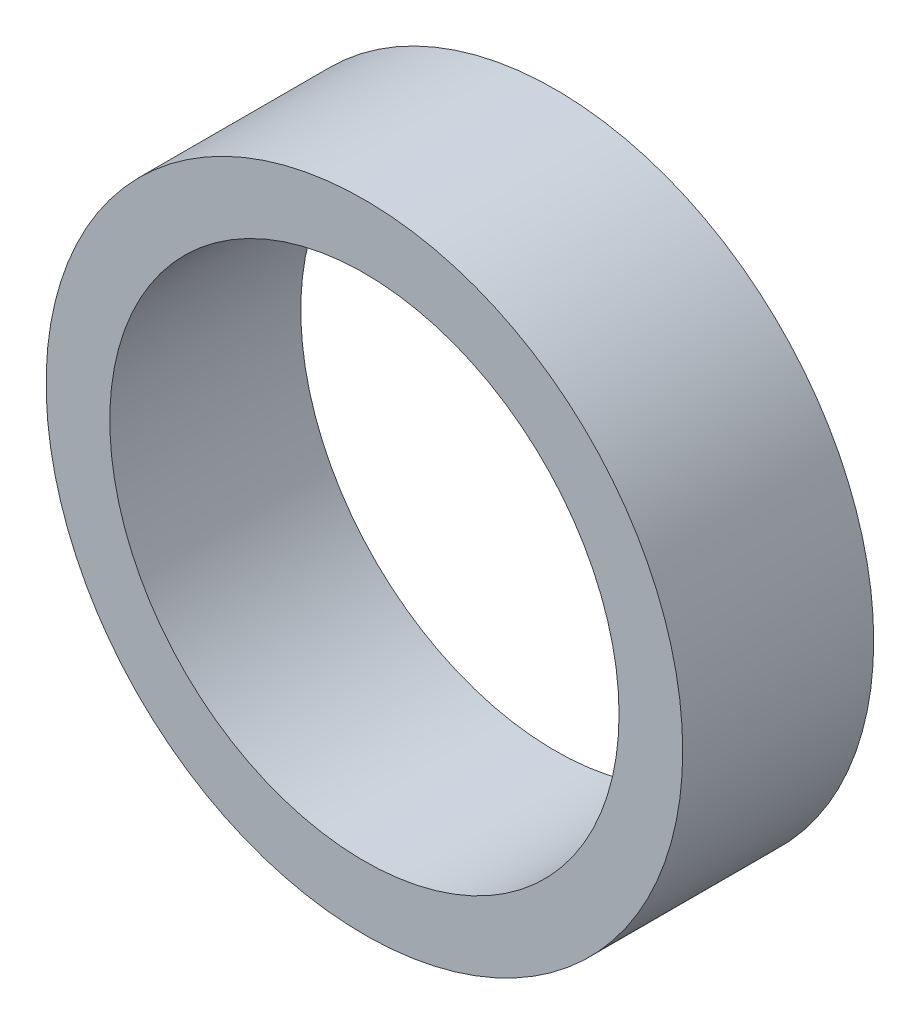
ISO-10303-21;
HEADER;
FILE_DESCRIPTION(('STEP AP214'),'2;1');
FILE_NAME('part.step','',(''),(''),'','','');
FILE_SCHEMA(('AUTOMOTIVE_DESIGN { 1 0 10303 214 1 1 1 1 }'));
ENDSEC;
DATA;
#1=APPLICATION_CONTEXT('core data for automotive mechanical design processes');
#2=APPLICATION_PROTOCOL_DEFINITION('international standard','automotive_design',2000,#1);
#3=PRODUCT_CONTEXT('',#1,'mechanical');
#4=PRODUCT('Part','Part','',(#3));
#5=PRODUCT_RELATED_PRODUCT_CATEGORY('part','',(#4));
#6=PRODUCT_DEFINITION_FORMATION('','',#4);
#7=PRODUCT_DEFINITION_CONTEXT('part definition',#1,'design');
#8=PRODUCT_DEFINITION('design','',#6,#7);
#9=PRODUCT_DEFINITION_SHAPE('','',#8);
#10=(LENGTH_UNIT() NAMED_UNIT(*) SI_UNIT(.MILLI.,.METRE.));
#11=(NAMED_UNIT(*) PLANE_ANGLE_UNIT() SI_UNIT($,.RADIAN.));
#12=(NAMED_UNIT(*) SI_UNIT($,.STERADIAN.) SOLID_ANGLE_UNIT());
#13=UNCERTAINTY_MEASURE_WITH_UNIT(LENGTH_MEASURE(1.E-05),#10,'distance_accuracy_value','');
#14=(GEOMETRIC_REPRESENTATION_CONTEXT(3) GLOBAL_UNCERTAINTY_ASSIGNED_CONTEXT((#13)) GLOBAL_UNIT_ASSIGNED_CONTEXT((#10,
#11,#12)) REPRESENTATION_CONTEXT('',''));
#15=CARTESIAN_POINT('',(0.,0.,0.));
#16=DIRECTION('',(0.,0.,1.));
#17=DIRECTION('',(1.,0.,0.));
#18=AXIS2_PLACEMENT_3D('',#15,#16,#17);
#19=CARTESIAN_POINT('',(0.,0.,15.));
#20=DIRECTION('',(0.,0.,1.));
#21=DIRECTION('',(1.,0.,0.));
#22=AXIS2_PLACEMENT_3D('',#19,#20,#21);
#23=PLANE('',#22);
#24=CARTESIAN_POINT('',(0.,0.,15.));
#25=DIRECTION('',(0.,0.,1.));
#26=DIRECTION('',(1.,0.,0.));
#27=AXIS2_PLACEMENT_3D('',#24,#25,#26);
#28=CIRCLE('',#27,25.);
#29=CARTESIAN_POINT('',(25.,0.,15.));
#30=VERTEX_POINT('',#29);
#31=EDGE_CURVE('E10',#30,#30,#28,.T.);
#32=ORIENTED_EDGE('',*,*,#31,.T.);
#33=EDGE_LOOP('',(#32));
#34=FACE_BOUND('',#33,.T.);
#35=CARTESIAN_POINT('',(0.,0.,15.));
#36=DIRECTION('',(0.,0.,1.));
#37=DIRECTION('',(1.,0.,0.));
#38=AXIS2_PLACEMENT_3D('',#35,#36,#37);
#39=CIRCLE('',#38,20.);
#40=CARTESIAN_POINT('',(20.,0.,15.));
#41=VERTEX_POINT('',#40);
#42=EDGE_CURVE('E43',#41,#41,#39,.T.);
#43=ORIENTED_EDGE('',*,*,#42,.F.);
#44=EDGE_LOOP('',(#43));
#45=FACE_BOUND('',#44,.T.);
#46=ADVANCED_FACE('F32',(#34,#45),#23,.T.);
#47=CARTESIAN_POINT('',(0.,0.,0.));
#48=DIRECTION('',(0.,0.,1.));
#49=DIRECTION('',(1.,0.,0.));
#50=AXIS2_PLACEMENT_3D('',#47,#48,#49);
#51=PLANE('',#50);
#52=CARTESIAN_POINT('',(0.,0.,0.));
#53=DIRECTION('',(0.,0.,1.));
#54=DIRECTION('',(1.,0.,0.));
#55=AXIS2_PLACEMENT_3D('',#52,#53,#54);
#56=CIRCLE('',#55,25.);
#57=CARTESIAN_POINT('',(25.,0.,0.));
#58=VERTEX_POINT('',#57);
#59=EDGE_CURVE('E36',#58,#58,#56,.T.);
#60=ORIENTED_EDGE('',*,*,#59,.F.);
#61=EDGE_LOOP('',(#60));
#62=FACE_BOUND('',#61,.T.);
#63=CARTESIAN_POINT('',(0.,0.,0.));
#64=DIRECTION('',(0.,0.,1.));
#65=DIRECTION('',(1.,0.,0.));
#66=AXIS2_PLACEMENT_3D('',#63,#64,#65);
#67=CIRCLE('',#66,20.);
#68=CARTESIAN_POINT('',(20.,0.,0.));
#69=VERTEX_POINT('',#68);
#70=EDGE_CURVE('E45',#69,#69,#67,.T.);
#71=ORIENTED_EDGE('',*,*,#70,.T.);
#72=EDGE_LOOP('',(#71));
#73=FACE_BOUND('',#72,.T.);
#74=ADVANCED_FACE('F55',(#62,#73),#51,.F.);
#75=CARTESIAN_POINT('',(0.,0.,15.));
#76=DIRECTION('',(0.,0.,-1.));
#77=DIRECTION('',(-1.,0.,0.));
#78=AXIS2_PLACEMENT_3D('',#75,#76,#77);
#79=CYLINDRICAL_SURFACE('',#78,25.);
#80=ORIENTED_EDGE('',*,*,#31,.F.);
#81=EDGE_LOOP('',(#80));
#82=FACE_BOUND('',#81,.T.);
#83=ORIENTED_EDGE('',*,*,#59,.T.);
#84=EDGE_LOOP('',(#83));
#85=FACE_BOUND('',#84,.T.);
#86=ADVANCED_FACE('F34',(#82,#85),#79,.T.);
#87=CARTESIAN_POINT('',(0.,0.,15.));
#88=DIRECTION('',(0.,0.,-1.));
#89=DIRECTION('',(-1.,0.,0.));
#90=AXIS2_PLACEMENT_3D('',#87,#88,#89);
#91=CYLINDRICAL_SURFACE('',#90,20.);
#92=ORIENTED_EDGE('',*,*,#42,.T.);
#93=EDGE_LOOP('',(#92));
#94=FACE_BOUND('',#93,.T.);
#95=ORIENTED_EDGE('',*,*,#70,.F.);
#96=EDGE_LOOP('',(#95));
#97=FACE_BOUND('',#96,.T.);
#98=ADVANCED_FACE('F51',(#94,#97),#91,.F.);
#99=CLOSED_SHELL('',(#46,#74,#86,#98));
#100=MANIFOLD_SOLID_BREP('B2',#99);
#101=ADVANCED_BREP_SHAPE_REPRESENTATION('',(#18,#100),#14);
#102=SHAPE_DEFINITION_REPRESENTATION(#9,#101);
ENDSEC;
END-ISO-10303-21;
